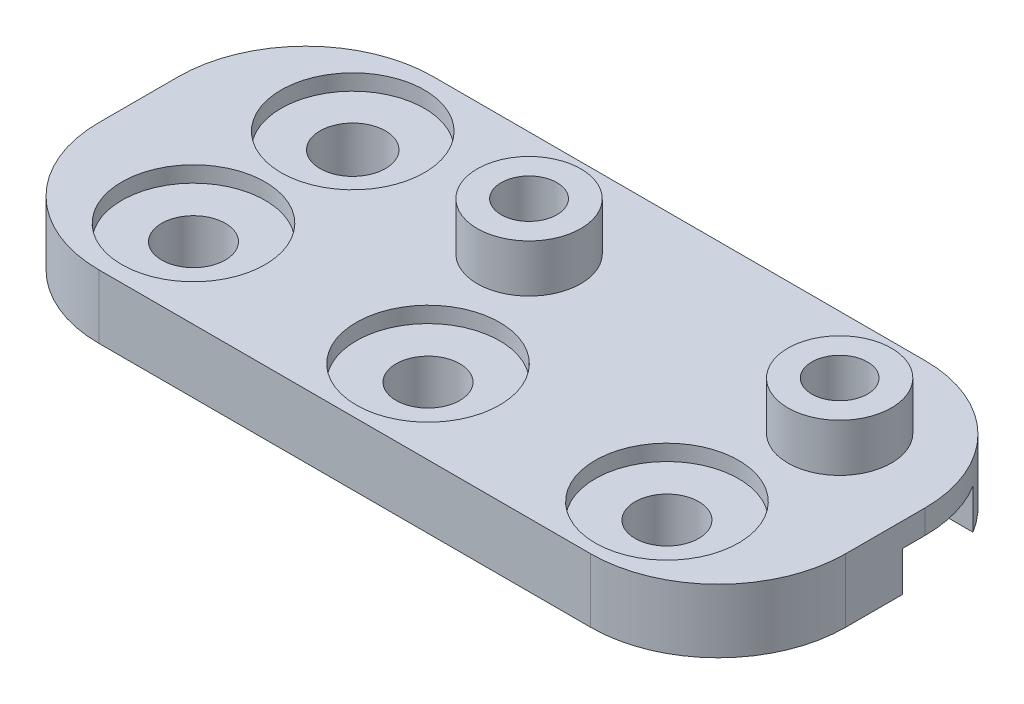
ISO-10303-21;
HEADER;
FILE_DESCRIPTION(('STEP AP214'),'2;1');
FILE_NAME('part.step','',(''),(''),'','','');
FILE_SCHEMA(('AUTOMOTIVE_DESIGN { 1 0 10303 214 1 1 1 1 }'));
ENDSEC;
DATA;
#1=APPLICATION_CONTEXT('core data for automotive mechanical design processes');
#2=APPLICATION_PROTOCOL_DEFINITION('international standard','automotive_design',2000,#1);
#3=PRODUCT_CONTEXT('',#1,'mechanical');
#4=PRODUCT('Part','Part','',(#3));
#5=PRODUCT_RELATED_PRODUCT_CATEGORY('part','',(#4));
#6=PRODUCT_DEFINITION_FORMATION('','',#4);
#7=PRODUCT_DEFINITION_CONTEXT('part definition',#1,'design');
#8=PRODUCT_DEFINITION('design','',#6,#7);
#9=PRODUCT_DEFINITION_SHAPE('','',#8);
#10=(LENGTH_UNIT() NAMED_UNIT(*) SI_UNIT(.MILLI.,.METRE.));
#11=(NAMED_UNIT(*) PLANE_ANGLE_UNIT() SI_UNIT($,.RADIAN.));
#12=(NAMED_UNIT(*) SI_UNIT($,.STERADIAN.) SOLID_ANGLE_UNIT());
#13=UNCERTAINTY_MEASURE_WITH_UNIT(LENGTH_MEASURE(1.E-05),#10,'distance_accuracy_value','');
#14=(GEOMETRIC_REPRESENTATION_CONTEXT(3) GLOBAL_UNCERTAINTY_ASSIGNED_CONTEXT((#13)) GLOBAL_UNIT_ASSIGNED_CONTEXT((#10,
#11,#12)) REPRESENTATION_CONTEXT('',''));
#15=CARTESIAN_POINT('',(0.,0.,0.));
#16=DIRECTION('',(0.,0.,1.));
#17=DIRECTION('',(1.,0.,0.));
#18=AXIS2_PLACEMENT_3D('',#15,#16,#17);
#19=CARTESIAN_POINT('',(23.4419140413245,4.,0.));
#20=DIRECTION('',(1.,0.,0.));
#21=DIRECTION('',(0.,0.,-1.));
#22=AXIS2_PLACEMENT_3D('',#19,#20,#21);
#23=PLANE('',#22);
#24=DIRECTION('',(0.,0.,1.));
#25=VECTOR('',#24,1.);
#26=CARTESIAN_POINT('',(23.4419140413245,0.,0.));
#27=LINE('',#26,#25);
#28=CARTESIAN_POINT('',(23.4419140413245,0.,-2.4));
#29=VERTEX_POINT('',#28);
#30=CARTESIAN_POINT('',(23.4419140413245,0.,1.17052230901994));
#31=VERTEX_POINT('',#30);
#32=EDGE_CURVE('E249',#29,#31,#27,.T.);
#33=ORIENTED_EDGE('',*,*,#32,.F.);
#34=DIRECTION('',(0.,-1.,0.));
#35=VECTOR('',#34,1.);
#36=CARTESIAN_POINT('',(23.4419140413245,2.5,-2.4));
#37=LINE('',#36,#35);
#38=CARTESIAN_POINT('',(23.4419140413245,2.5,-2.4));
#39=VERTEX_POINT('',#38);
#40=EDGE_CURVE('E164',#39,#29,#37,.T.);
#41=ORIENTED_EDGE('',*,*,#40,.F.);
#42=DIRECTION('',(0.,0.,1.));
#43=VECTOR('',#42,1.);
#44=CARTESIAN_POINT('',(23.4419140413245,2.5,0.));
#45=LINE('',#44,#43);
#46=CARTESIAN_POINT('',(23.4419140413245,2.5,-3.82947769098007));
#47=VERTEX_POINT('',#46);
#48=EDGE_CURVE('E145',#47,#39,#45,.T.);
#49=ORIENTED_EDGE('',*,*,#48,.F.);
#50=DIRECTION('',(0.,-1.,0.));
#51=VECTOR('',#50,1.);
#52=CARTESIAN_POINT('',(23.4419140413245,4.,-3.82947769098007));
#53=LINE('',#52,#51);
#54=CARTESIAN_POINT('',(23.4419140413245,4.,-3.82947769098007));
#55=VERTEX_POINT('',#54);
#56=EDGE_CURVE('E283',#47,#55,#53,.F.);
#57=ORIENTED_EDGE('',*,*,#56,.T.);
#58=DIRECTION('',(0.,0.,1.));
#59=VECTOR('',#58,1.);
#60=CARTESIAN_POINT('',(23.4419140413245,4.,0.));
#61=LINE('',#60,#59);
#62=CARTESIAN_POINT('',(23.4419140413245,4.,1.17052230901994));
#63=VERTEX_POINT('',#62);
#64=EDGE_CURVE('E235',#55,#63,#61,.T.);
#65=ORIENTED_EDGE('',*,*,#64,.T.);
#66=DIRECTION('',(0.,-1.,0.));
#67=VECTOR('',#66,1.);
#68=CARTESIAN_POINT('',(23.4419140413245,0.,1.17052230901994));
#69=LINE('',#68,#67);
#70=EDGE_CURVE('E285',#63,#31,#69,.T.);
#71=ORIENTED_EDGE('',*,*,#70,.T.);
#72=EDGE_LOOP('',(#33,#41,#49,#57,#65,#71));
#73=FACE_BOUND('',#72,.T.);
#74=ADVANCED_FACE('F35',(#73),#23,.T.);
#75=CARTESIAN_POINT('',(0.,0.,0.));
#76=DIRECTION('',(0.,1.,0.));
#77=DIRECTION('',(0.,0.,1.));
#78=AXIS2_PLACEMENT_3D('',#75,#76,#77);
#79=PLANE('',#78);
#80=CARTESIAN_POINT('',(-14.9975098421736,0.,3.67052230901994));
#81=DIRECTION('',(0.,1.,0.));
#82=DIRECTION('',(0.,0.,1.));
#83=AXIS2_PLACEMENT_3D('',#80,#81,#82);
#84=CIRCLE('',#83,2.);
#85=CARTESIAN_POINT('',(-14.9975098421736,0.,5.67052230901994));
#86=VERTEX_POINT('',#85);
#87=EDGE_CURVE('E224',#86,#86,#84,.T.);
#88=ORIENTED_EDGE('',*,*,#87,.T.);
#89=EDGE_LOOP('',(#88));
#90=FACE_BOUND('',#89,.T.);
#91=CARTESIAN_POINT('',(-14.9975098421736,0.,-6.32947769098006));
#92=DIRECTION('',(0.,1.,0.));
#93=DIRECTION('',(0.,0.,1.));
#94=AXIS2_PLACEMENT_3D('',#91,#92,#93);
#95=CIRCLE('',#94,2.05405042790199);
#96=CARTESIAN_POINT('',(-14.9975098421736,0.,-4.27542726307808));
#97=VERTEX_POINT('',#96);
#98=EDGE_CURVE('E251',#97,#97,#95,.T.);
#99=ORIENTED_EDGE('',*,*,#98,.T.);
#100=EDGE_LOOP('',(#99));
#101=FACE_BOUND('',#100,.T.);
#102=CARTESIAN_POINT('',(0.,0.,3.94383263430374));
#103=DIRECTION('',(0.,1.,0.));
#104=DIRECTION('',(0.,0.,1.));
#105=AXIS2_PLACEMENT_3D('',#102,#103,#104);
#106=CIRCLE('',#105,2.);
#107=CARTESIAN_POINT('',(0.,0.,5.94383263430374));
#108=VERTEX_POINT('',#107);
#109=EDGE_CURVE('E219',#108,#108,#106,.T.);
#110=ORIENTED_EDGE('',*,*,#109,.T.);
#111=EDGE_LOOP('',(#110));
#112=FACE_BOUND('',#111,.T.);
#113=CARTESIAN_POINT('',(15.,0.,3.94383263430374));
#114=DIRECTION('',(0.,1.,0.));
#115=DIRECTION('',(0.,0.,1.));
#116=AXIS2_PLACEMENT_3D('',#113,#114,#115);
#117=CIRCLE('',#116,2.00000000000001);
#118=CARTESIAN_POINT('',(15.,0.,5.94383263430375));
#119=VERTEX_POINT('',#118);
#120=EDGE_CURVE('E188',#119,#119,#117,.T.);
#121=ORIENTED_EDGE('',*,*,#120,.T.);
#122=EDGE_LOOP('',(#121));
#123=FACE_BOUND('',#122,.T.);
#124=DIRECTION('',(1.,0.,0.));
#125=VECTOR('',#124,1.);
#126=CARTESIAN_POINT('',(0.,0.,-2.40000000000001));
#127=LINE('',#126,#125);
#128=CARTESIAN_POINT('',(-6.0331615074619,0.,-2.40000000000001));
#129=VERTEX_POINT('',#128);
#130=EDGE_CURVE('E138',#129,#29,#127,.T.);
#131=ORIENTED_EDGE('',*,*,#130,.T.);
#132=ORIENTED_EDGE('',*,*,#32,.T.);
#133=CARTESIAN_POINT('',(15.4419140413245,0.,1.17052230901993));
#134=DIRECTION('',(0.,1.,0.));
#135=DIRECTION('',(0.,0.,1.));
#136=AXIS2_PLACEMENT_3D('',#133,#134,#135);
#137=CIRCLE('',#136,8.);
#138=CARTESIAN_POINT('',(15.4419140413245,0.,9.17052230901994));
#139=VERTEX_POINT('',#138);
#140=EDGE_CURVE('E267',#31,#139,#137,.F.);
#141=ORIENTED_EDGE('',*,*,#140,.T.);
#142=DIRECTION('',(1.,0.,0.));
#143=VECTOR('',#142,1.);
#144=CARTESIAN_POINT('',(0.,0.,9.17052230901994));
#145=LINE('',#144,#143);
#146=CARTESIAN_POINT('',(-15.4419140413245,0.,9.17052230901994));
#147=VERTEX_POINT('',#146);
#148=EDGE_CURVE('E246',#147,#139,#145,.T.);
#149=ORIENTED_EDGE('',*,*,#148,.F.);
#150=CARTESIAN_POINT('',(-15.4419140413245,0.,1.17052230901993));
#151=DIRECTION('',(0.,1.,0.));
#152=DIRECTION('',(0.,0.,1.));
#153=AXIS2_PLACEMENT_3D('',#150,#151,#152);
#154=CIRCLE('',#153,8.);
#155=CARTESIAN_POINT('',(-23.4419140413245,0.,1.17052230901994));
#156=VERTEX_POINT('',#155);
#157=EDGE_CURVE('E269',#147,#156,#154,.F.);
#158=ORIENTED_EDGE('',*,*,#157,.T.);
#159=DIRECTION('',(0.,0.,1.));
#160=VECTOR('',#159,1.);
#161=CARTESIAN_POINT('',(-23.4419140413245,0.,0.));
#162=LINE('',#161,#160);
#163=CARTESIAN_POINT('',(-23.4419140413245,0.,-3.82947769098006));
#164=VERTEX_POINT('',#163);
#165=EDGE_CURVE('E243',#164,#156,#162,.T.);
#166=ORIENTED_EDGE('',*,*,#165,.F.);
#167=CARTESIAN_POINT('',(-15.4419140413245,0.,-3.82947769098006));
#168=DIRECTION('',(0.,1.,0.));
#169=DIRECTION('',(0.,0.,1.));
#170=AXIS2_PLACEMENT_3D('',#167,#168,#169);
#171=CIRCLE('',#170,8.);
#172=CARTESIAN_POINT('',(-15.4419140413245,0.,-11.8294776909801));
#173=VERTEX_POINT('',#172);
#174=EDGE_CURVE('E265',#164,#173,#171,.F.);
#175=ORIENTED_EDGE('',*,*,#174,.T.);
#176=DIRECTION('',(1.,0.,0.));
#177=VECTOR('',#176,1.);
#178=CARTESIAN_POINT('',(0.,0.,-11.8294776909801));
#179=LINE('',#178,#177);
#180=CARTESIAN_POINT('',(15.4419140413245,0.,-11.8294776909801));
#181=VERTEX_POINT('',#180);
#182=EDGE_CURVE('E240',#173,#181,#179,.T.);
#183=ORIENTED_EDGE('',*,*,#182,.T.);
#184=CARTESIAN_POINT('',(15.4419140413245,0.,-3.82947769098007));
#185=DIRECTION('',(0.,1.,0.));
#186=DIRECTION('',(0.,0.,1.));
#187=AXIS2_PLACEMENT_3D('',#184,#185,#186);
#188=CIRCLE('',#187,8.);
#189=CARTESIAN_POINT('',(22.2688272288469,0.,-8.00000000000001));
#190=VERTEX_POINT('',#189);
#191=EDGE_CURVE('E262',#181,#190,#188,.F.);
#192=ORIENTED_EDGE('',*,*,#191,.T.);
#193=DIRECTION('',(-1.,0.,0.));
#194=VECTOR('',#193,1.);
#195=CARTESIAN_POINT('',(0.,0.,-8.));
#196=LINE('',#195,#194);
#197=CARTESIAN_POINT('',(-6.0331615074619,0.,-8.));
#198=VERTEX_POINT('',#197);
#199=EDGE_CURVE('E147',#190,#198,#196,.T.);
#200=ORIENTED_EDGE('',*,*,#199,.T.);
#201=DIRECTION('',(0.,0.,1.));
#202=VECTOR('',#201,1.);
#203=CARTESIAN_POINT('',(-6.0331615074619,0.,0.));
#204=LINE('',#203,#202);
#205=EDGE_CURVE('E150',#198,#129,#204,.T.);
#206=ORIENTED_EDGE('',*,*,#205,.T.);
#207=EDGE_LOOP('',(#131,#132,#141,#149,#158,#166,#175,#183,#192,#200,#206));
#208=FACE_BOUND('',#207,.T.);
#209=ADVANCED_FACE('F297',(#90,#101,#112,#123,#208),#79,.F.);
#210=CARTESIAN_POINT('',(-2.8,7.001,-5.2));
#211=DIRECTION('',(0.,-1.,0.));
#212=DIRECTION('',(0.,0.,-1.));
#213=AXIS2_PLACEMENT_3D('',#210,#211,#212);
#214=CYLINDRICAL_SURFACE('',#213,1.75);
#215=CARTESIAN_POINT('',(-2.8,7.,-5.2));
#216=DIRECTION('',(0.,1.,0.));
#217=DIRECTION('',(0.,0.,1.));
#218=AXIS2_PLACEMENT_3D('',#215,#216,#217);
#219=CIRCLE('',#218,1.75);
#220=CARTESIAN_POINT('',(-2.8,7.,-3.45));
#221=VERTEX_POINT('',#220);
#222=EDGE_CURVE('E207',#221,#221,#219,.T.);
#223=ORIENTED_EDGE('',*,*,#222,.T.);
#224=EDGE_LOOP('',(#223));
#225=FACE_BOUND('',#224,.T.);
#226=CARTESIAN_POINT('',(-2.8,2.5,-5.2));
#227=DIRECTION('',(0.,-1.,0.));
#228=DIRECTION('',(0.,0.,-1.));
#229=AXIS2_PLACEMENT_3D('',#226,#227,#228);
#230=CIRCLE('',#229,1.75);
#231=CARTESIAN_POINT('',(-2.8,2.5,-6.95));
#232=VERTEX_POINT('',#231);
#233=EDGE_CURVE('E140',#232,#232,#230,.F.);
#234=ORIENTED_EDGE('',*,*,#233,.F.);
#235=EDGE_LOOP('',(#234));
#236=FACE_BOUND('',#235,.T.);
#237=ADVANCED_FACE('F341',(#225,#236),#214,.F.);
#238=CARTESIAN_POINT('',(16.7,7.001,-5.2));
#239=DIRECTION('',(0.,-1.,0.));
#240=DIRECTION('',(0.,0.,-1.));
#241=AXIS2_PLACEMENT_3D('',#238,#239,#240);
#242=CYLINDRICAL_SURFACE('',#241,1.75);
#243=CARTESIAN_POINT('',(16.7,7.,-5.2));
#244=DIRECTION('',(0.,1.,0.));
#245=DIRECTION('',(0.,0.,1.));
#246=AXIS2_PLACEMENT_3D('',#243,#244,#245);
#247=CIRCLE('',#246,1.75);
#248=CARTESIAN_POINT('',(16.7,7.,-3.45));
#249=VERTEX_POINT('',#248);
#250=EDGE_CURVE('E211',#249,#249,#247,.T.);
#251=ORIENTED_EDGE('',*,*,#250,.T.);
#252=EDGE_LOOP('',(#251));
#253=FACE_BOUND('',#252,.T.);
#254=CARTESIAN_POINT('',(16.7,2.5,-5.2));
#255=DIRECTION('',(0.,-1.,0.));
#256=DIRECTION('',(0.,0.,-1.));
#257=AXIS2_PLACEMENT_3D('',#254,#255,#256);
#258=CIRCLE('',#257,1.75);
#259=CARTESIAN_POINT('',(16.7,2.5,-6.95));
#260=VERTEX_POINT('',#259);
#261=EDGE_CURVE('E157',#260,#260,#258,.F.);
#262=ORIENTED_EDGE('',*,*,#261,.F.);
#263=EDGE_LOOP('',(#262));
#264=FACE_BOUND('',#263,.T.);
#265=ADVANCED_FACE('F420',(#253,#264),#242,.F.);
#266=CARTESIAN_POINT('',(15.4419140413245,4.,-3.82947769098007));
#267=DIRECTION('',(0.,-1.,0.));
#268=DIRECTION('',(0.,0.,-1.));
#269=AXIS2_PLACEMENT_3D('',#266,#267,#268);
#270=CYLINDRICAL_SURFACE('',#269,8.);
#271=CARTESIAN_POINT('',(15.4419140413245,2.5,-3.82947769098007));
#272=DIRECTION('',(0.,-1.,0.));
#273=DIRECTION('',(0.,0.,-1.));
#274=AXIS2_PLACEMENT_3D('',#271,#272,#273);
#275=CIRCLE('',#274,8.);
#276=CARTESIAN_POINT('',(22.2688272288469,2.5,-8.));
#277=VERTEX_POINT('',#276);
#278=EDGE_CURVE('E154',#277,#47,#275,.T.);
#279=ORIENTED_EDGE('',*,*,#278,.F.);
#280=DIRECTION('',(0.,-1.,0.));
#281=VECTOR('',#280,1.);
#282=CARTESIAN_POINT('',(22.2688272288469,2.5,-8.00000000000001));
#283=LINE('',#282,#281);
#284=EDGE_CURVE('E167',#277,#190,#283,.T.);
#285=ORIENTED_EDGE('',*,*,#284,.T.);
#286=ORIENTED_EDGE('',*,*,#191,.F.);
#287=DIRECTION('',(0.,-1.,0.));
#288=VECTOR('',#287,1.);
#289=CARTESIAN_POINT('',(15.4419140413245,4.,-11.8294776909801));
#290=LINE('',#289,#288);
#291=CARTESIAN_POINT('',(15.4419140413245,4.,-11.8294776909801));
#292=VERTEX_POINT('',#291);
#293=EDGE_CURVE('E43',#292,#181,#290,.T.);
#294=ORIENTED_EDGE('',*,*,#293,.F.);
#295=CARTESIAN_POINT('',(15.4419140413245,4.,-3.82947769098007));
#296=DIRECTION('',(0.,1.,0.));
#297=DIRECTION('',(0.,0.,1.));
#298=AXIS2_PLACEMENT_3D('',#295,#296,#297);
#299=CIRCLE('',#298,8.);
#300=EDGE_CURVE('E276',#55,#292,#299,.T.);
#301=ORIENTED_EDGE('',*,*,#300,.F.);
#302=ORIENTED_EDGE('',*,*,#56,.F.);
#303=EDGE_LOOP('',(#279,#285,#286,#294,#301,#302));
#304=FACE_BOUND('',#303,.T.);
#305=ADVANCED_FACE('F37',(#304),#270,.T.);
#306=CARTESIAN_POINT('',(0.,4.,3.94383263430374));
#307=DIRECTION('',(0.,-1.,0.));
#308=DIRECTION('',(0.,0.,-1.));
#309=AXIS2_PLACEMENT_3D('',#306,#307,#308);
#310=CYLINDRICAL_SURFACE('',#309,2.);
#311=ORIENTED_EDGE('',*,*,#109,.F.);
#312=EDGE_LOOP('',(#311));
#313=FACE_BOUND('',#312,.T.);
#314=CARTESIAN_POINT('',(0.,3.,3.94383263430374));
#315=DIRECTION('',(0.,1.,0.));
#316=DIRECTION('',(0.,0.,1.));
#317=AXIS2_PLACEMENT_3D('',#314,#315,#316);
#318=CIRCLE('',#317,2.00000000000001);
#319=CARTESIAN_POINT('',(0.,3.,5.94383263430376));
#320=VERTEX_POINT('',#319);
#321=EDGE_CURVE('E176',#320,#320,#318,.T.);
#322=ORIENTED_EDGE('',*,*,#321,.T.);
#323=EDGE_LOOP('',(#322));
#324=FACE_BOUND('',#323,.T.);
#325=ADVANCED_FACE('F355',(#313,#324),#310,.F.);
#326=CARTESIAN_POINT('',(-14.9975098421736,4.,3.67052230901994));
#327=DIRECTION('',(0.,-1.,0.));
#328=DIRECTION('',(0.,0.,-1.));
#329=AXIS2_PLACEMENT_3D('',#326,#327,#328);
#330=CYLINDRICAL_SURFACE('',#329,2.);
#331=ORIENTED_EDGE('',*,*,#87,.F.);
#332=EDGE_LOOP('',(#331));
#333=FACE_BOUND('',#332,.T.);
#334=CARTESIAN_POINT('',(-14.9975098421736,3.,3.67052230901994));
#335=DIRECTION('',(0.,1.,0.));
#336=DIRECTION('',(0.,0.,1.));
#337=AXIS2_PLACEMENT_3D('',#334,#335,#336);
#338=CIRCLE('',#337,2.00000000000001);
#339=CARTESIAN_POINT('',(-14.9975098421736,3.,5.67052230901995));
#340=VERTEX_POINT('',#339);
#341=EDGE_CURVE('E197',#340,#340,#338,.T.);
#342=ORIENTED_EDGE('',*,*,#341,.T.);
#343=EDGE_LOOP('',(#342));
#344=FACE_BOUND('',#343,.T.);
#345=ADVANCED_FACE('F354',(#333,#344),#330,.F.);
#346=CARTESIAN_POINT('',(0.,4.,-11.8294776909801));
#347=DIRECTION('',(0.,0.,-1.));
#348=DIRECTION('',(-1.,0.,0.));
#349=AXIS2_PLACEMENT_3D('',#346,#347,#348);
#350=PLANE('',#349);
#351=ORIENTED_EDGE('',*,*,#182,.F.);
#352=DIRECTION('',(0.,-1.,0.));
#353=VECTOR('',#352,1.);
#354=CARTESIAN_POINT('',(-15.4419140413245,4.,-11.8294776909801));
#355=LINE('',#354,#353);
#356=CARTESIAN_POINT('',(-15.4419140413245,4.,-11.8294776909801));
#357=VERTEX_POINT('',#356);
#358=EDGE_CURVE('E11',#173,#357,#355,.F.);
#359=ORIENTED_EDGE('',*,*,#358,.T.);
#360=DIRECTION('',(1.,0.,0.));
#361=VECTOR('',#360,1.);
#362=CARTESIAN_POINT('',(0.,4.,-11.8294776909801));
#363=LINE('',#362,#361);
#364=EDGE_CURVE('E227',#357,#292,#363,.T.);
#365=ORIENTED_EDGE('',*,*,#364,.T.);
#366=ORIENTED_EDGE('',*,*,#293,.T.);
#367=EDGE_LOOP('',(#351,#359,#365,#366));
#368=FACE_BOUND('',#367,.T.);
#369=ADVANCED_FACE('F291',(#368),#350,.T.);
#370=CARTESIAN_POINT('',(-23.4419140413245,4.,0.));
#371=DIRECTION('',(1.,0.,0.));
#372=DIRECTION('',(0.,0.,-1.));
#373=AXIS2_PLACEMENT_3D('',#370,#371,#372);
#374=PLANE('',#373);
#375=ORIENTED_EDGE('',*,*,#165,.T.);
#376=DIRECTION('',(0.,-1.,0.));
#377=VECTOR('',#376,1.);
#378=CARTESIAN_POINT('',(-23.4419140413245,4.,1.17052230901994));
#379=LINE('',#378,#377);
#380=CARTESIAN_POINT('',(-23.4419140413245,4.,1.17052230901994));
#381=VERTEX_POINT('',#380);
#382=EDGE_CURVE('E274',#156,#381,#379,.F.);
#383=ORIENTED_EDGE('',*,*,#382,.T.);
#384=DIRECTION('',(0.,0.,1.));
#385=VECTOR('',#384,1.);
#386=CARTESIAN_POINT('',(-23.4419140413245,4.,0.));
#387=LINE('',#386,#385);
#388=CARTESIAN_POINT('',(-23.4419140413245,4.,-3.82947769098006));
#389=VERTEX_POINT('',#388);
#390=EDGE_CURVE('E230',#389,#381,#387,.T.);
#391=ORIENTED_EDGE('',*,*,#390,.F.);
#392=DIRECTION('',(0.,-1.,0.));
#393=VECTOR('',#392,1.);
#394=CARTESIAN_POINT('',(-23.4419140413245,0.,-3.82947769098006));
#395=LINE('',#394,#393);
#396=EDGE_CURVE('E271',#389,#164,#395,.T.);
#397=ORIENTED_EDGE('',*,*,#396,.T.);
#398=EDGE_LOOP('',(#375,#383,#391,#397));
#399=FACE_BOUND('',#398,.T.);
#400=ADVANCED_FACE('F305',(#399),#374,.F.);
#401=CARTESIAN_POINT('',(0.,4.,9.17052230901994));
#402=DIRECTION('',(0.,0.,-1.));
#403=DIRECTION('',(-1.,0.,0.));
#404=AXIS2_PLACEMENT_3D('',#401,#402,#403);
#405=PLANE('',#404);
#406=DIRECTION('',(1.,0.,0.));
#407=VECTOR('',#406,1.);
#408=CARTESIAN_POINT('',(0.,4.,9.17052230901994));
#409=LINE('',#408,#407);
#410=CARTESIAN_POINT('',(-15.4419140413245,4.,9.17052230901994));
#411=VERTEX_POINT('',#410);
#412=CARTESIAN_POINT('',(15.4419140413245,4.,9.17052230901994));
#413=VERTEX_POINT('',#412);
#414=EDGE_CURVE('E233',#411,#413,#409,.T.);
#415=ORIENTED_EDGE('',*,*,#414,.F.);
#416=DIRECTION('',(0.,-1.,0.));
#417=VECTOR('',#416,1.);
#418=CARTESIAN_POINT('',(-15.4419140413245,4.,9.17052230901994));
#419=LINE('',#418,#417);
#420=EDGE_CURVE('E259',#411,#147,#419,.T.);
#421=ORIENTED_EDGE('',*,*,#420,.T.);
#422=ORIENTED_EDGE('',*,*,#148,.T.);
#423=DIRECTION('',(0.,-1.,0.));
#424=VECTOR('',#423,1.);
#425=CARTESIAN_POINT('',(15.4419140413245,4.,9.17052230901994));
#426=LINE('',#425,#424);
#427=EDGE_CURVE('E237',#139,#413,#426,.F.);
#428=ORIENTED_EDGE('',*,*,#427,.T.);
#429=EDGE_LOOP('',(#415,#421,#422,#428));
#430=FACE_BOUND('',#429,.T.);
#431=ADVANCED_FACE('F315',(#430),#405,.F.);
#432=CARTESIAN_POINT('',(-14.9975098421736,4.,-6.32947769098006));
#433=DIRECTION('',(0.,-1.,0.));
#434=DIRECTION('',(0.,0.,-1.));
#435=AXIS2_PLACEMENT_3D('',#432,#433,#434);
#436=CYLINDRICAL_SURFACE('',#435,2.05405042790199);
#437=CARTESIAN_POINT('',(-14.9975098421736,3.,-6.32947769098006));
#438=DIRECTION('',(0.,-1.,0.));
#439=DIRECTION('',(0.,0.,-1.));
#440=AXIS2_PLACEMENT_3D('',#437,#438,#439);
#441=CIRCLE('',#440,2.05405042790199);
#442=CARTESIAN_POINT('',(-14.9975098421736,3.,-8.38352811888205));
#443=VERTEX_POINT('',#442);
#444=EDGE_CURVE('E206',#443,#443,#441,.T.);
#445=ORIENTED_EDGE('',*,*,#444,.F.);
#446=EDGE_LOOP('',(#445));
#447=FACE_BOUND('',#446,.T.);
#448=ORIENTED_EDGE('',*,*,#98,.F.);
#449=EDGE_LOOP('',(#448));
#450=FACE_BOUND('',#449,.T.);
#451=ADVANCED_FACE('F346',(#447,#450),#436,.F.);
#452=CARTESIAN_POINT('',(0.,4.,0.));
#453=DIRECTION('',(0.,1.,0.));
#454=DIRECTION('',(0.,0.,1.));
#455=AXIS2_PLACEMENT_3D('',#452,#453,#454);
#456=PLANE('',#455);
#457=CARTESIAN_POINT('',(0.,4.,3.94383263430374));
#458=DIRECTION('',(0.,1.,0.));
#459=DIRECTION('',(0.,0.,1.));
#460=AXIS2_PLACEMENT_3D('',#457,#458,#459);
#461=CIRCLE('',#460,4.50000000000001);
#462=CARTESIAN_POINT('',(0.,4.,8.44383263430375));
#463=VERTEX_POINT('',#462);
#464=EDGE_CURVE('E166',#463,#463,#461,.T.);
#465=ORIENTED_EDGE('',*,*,#464,.F.);
#466=EDGE_LOOP('',(#465));
#467=FACE_BOUND('',#466,.T.);
#468=CARTESIAN_POINT('',(15.,4.,3.94383263430374));
#469=DIRECTION('',(0.,1.,0.));
#470=DIRECTION('',(0.,0.,1.));
#471=AXIS2_PLACEMENT_3D('',#468,#469,#470);
#472=CIRCLE('',#471,4.50000000000001);
#473=CARTESIAN_POINT('',(15.,4.,8.44383263430375));
#474=VERTEX_POINT('',#473);
#475=EDGE_CURVE('E179',#474,#474,#472,.T.);
#476=ORIENTED_EDGE('',*,*,#475,.F.);
#477=EDGE_LOOP('',(#476));
#478=FACE_BOUND('',#477,.T.);
#479=CARTESIAN_POINT('',(-14.9975098421736,4.,3.67052230901994));
#480=DIRECTION('',(0.,1.,0.));
#481=DIRECTION('',(0.,0.,1.));
#482=AXIS2_PLACEMENT_3D('',#479,#480,#481);
#483=CIRCLE('',#482,4.50000000000001);
#484=CARTESIAN_POINT('',(-14.9975098421736,4.,8.17052230901995));
#485=VERTEX_POINT('',#484);
#486=EDGE_CURVE('E191',#485,#485,#483,.T.);
#487=ORIENTED_EDGE('',*,*,#486,.F.);
#488=EDGE_LOOP('',(#487));
#489=FACE_BOUND('',#488,.T.);
#490=CARTESIAN_POINT('',(-14.9975098421736,4.,-6.32947769098006));
#491=DIRECTION('',(0.,1.,0.));
#492=DIRECTION('',(0.,0.,1.));
#493=AXIS2_PLACEMENT_3D('',#490,#491,#492);
#494=CIRCLE('',#493,4.50000000000001);
#495=CARTESIAN_POINT('',(-14.9975098421736,4.,-1.82947769098005));
#496=VERTEX_POINT('',#495);
#497=EDGE_CURVE('E200',#496,#496,#494,.T.);
#498=ORIENTED_EDGE('',*,*,#497,.F.);
#499=EDGE_LOOP('',(#498));
#500=FACE_BOUND('',#499,.T.);
#501=CARTESIAN_POINT('',(-2.8,4.,-5.2));
#502=DIRECTION('',(0.,1.,0.));
#503=DIRECTION('',(0.,0.,1.));
#504=AXIS2_PLACEMENT_3D('',#501,#502,#503);
#505=CIRCLE('',#504,3.25);
#506=CARTESIAN_POINT('',(-2.8,4.,-1.95));
#507=VERTEX_POINT('',#506);
#508=EDGE_CURVE('E220',#507,#507,#505,.T.);
#509=ORIENTED_EDGE('',*,*,#508,.F.);
#510=EDGE_LOOP('',(#509));
#511=FACE_BOUND('',#510,.T.);
#512=CARTESIAN_POINT('',(16.7,4.,-5.2));
#513=DIRECTION('',(0.,1.,0.));
#514=DIRECTION('',(0.,0.,1.));
#515=AXIS2_PLACEMENT_3D('',#512,#513,#514);
#516=CIRCLE('',#515,3.25);
#517=CARTESIAN_POINT('',(16.7,4.,-1.95));
#518=VERTEX_POINT('',#517);
#519=EDGE_CURVE('E223',#518,#518,#516,.T.);
#520=ORIENTED_EDGE('',*,*,#519,.F.);
#521=EDGE_LOOP('',(#520));
#522=FACE_BOUND('',#521,.T.);
#523=ORIENTED_EDGE('',*,*,#390,.T.);
#524=CARTESIAN_POINT('',(-15.4419140413245,4.,1.17052230901993));
#525=DIRECTION('',(0.,1.,0.));
#526=DIRECTION('',(0.,0.,1.));
#527=AXIS2_PLACEMENT_3D('',#524,#525,#526);
#528=CIRCLE('',#527,8.);
#529=EDGE_CURVE('E281',#381,#411,#528,.T.);
#530=ORIENTED_EDGE('',*,*,#529,.T.);
#531=ORIENTED_EDGE('',*,*,#414,.T.);
#532=CARTESIAN_POINT('',(15.4419140413245,4.,1.17052230901993));
#533=DIRECTION('',(0.,1.,0.));
#534=DIRECTION('',(0.,0.,1.));
#535=AXIS2_PLACEMENT_3D('',#532,#533,#534);
#536=CIRCLE('',#535,8.);
#537=EDGE_CURVE('E58',#413,#63,#536,.T.);
#538=ORIENTED_EDGE('',*,*,#537,.T.);
#539=ORIENTED_EDGE('',*,*,#64,.F.);
#540=ORIENTED_EDGE('',*,*,#300,.T.);
#541=ORIENTED_EDGE('',*,*,#364,.F.);
#542=CARTESIAN_POINT('',(-15.4419140413245,4.,-3.82947769098006));
#543=DIRECTION('',(0.,1.,0.));
#544=DIRECTION('',(0.,0.,1.));
#545=AXIS2_PLACEMENT_3D('',#542,#543,#544);
#546=CIRCLE('',#545,8.);
#547=EDGE_CURVE('E278',#357,#389,#546,.T.);
#548=ORIENTED_EDGE('',*,*,#547,.T.);
#549=EDGE_LOOP('',(#523,#530,#531,#538,#539,#540,#541,#548));
#550=FACE_BOUND('',#549,.T.);
#551=ADVANCED_FACE('F308',(#467,#478,#489,#500,#511,#522,#550),#456,.T.);
#552=CARTESIAN_POINT('',(16.7,7.,-5.2));
#553=DIRECTION('',(0.,-1.,0.));
#554=DIRECTION('',(0.,0.,-1.));
#555=AXIS2_PLACEMENT_3D('',#552,#553,#554);
#556=CYLINDRICAL_SURFACE('',#555,3.25);
#557=ORIENTED_EDGE('',*,*,#519,.T.);
#558=EDGE_LOOP('',(#557));
#559=FACE_BOUND('',#558,.T.);
#560=CARTESIAN_POINT('',(16.7,7.,-5.2));
#561=DIRECTION('',(0.,1.,0.));
#562=DIRECTION('',(0.,0.,1.));
#563=AXIS2_PLACEMENT_3D('',#560,#561,#562);
#564=CIRCLE('',#563,3.25);
#565=CARTESIAN_POINT('',(16.7,7.,-1.95));
#566=VERTEX_POINT('',#565);
#567=EDGE_CURVE('E216',#566,#566,#564,.T.);
#568=ORIENTED_EDGE('',*,*,#567,.F.);
#569=EDGE_LOOP('',(#568));
#570=FACE_BOUND('',#569,.T.);
#571=ADVANCED_FACE('F484',(#559,#570),#556,.T.);
#572=CARTESIAN_POINT('',(0.,7.,0.));
#573=DIRECTION('',(0.,1.,0.));
#574=DIRECTION('',(0.,0.,1.));
#575=AXIS2_PLACEMENT_3D('',#572,#573,#574);
#576=PLANE('',#575);
#577=ORIENTED_EDGE('',*,*,#250,.F.);
#578=EDGE_LOOP('',(#577));
#579=FACE_BOUND('',#578,.T.);
#580=ORIENTED_EDGE('',*,*,#567,.T.);
#581=EDGE_LOOP('',(#580));
#582=FACE_BOUND('',#581,.T.);
#583=ADVANCED_FACE('F480',(#579,#582),#576,.T.);
#584=CARTESIAN_POINT('',(-2.8,7.,-5.2));
#585=DIRECTION('',(0.,-1.,0.));
#586=DIRECTION('',(0.,0.,-1.));
#587=AXIS2_PLACEMENT_3D('',#584,#585,#586);
#588=CYLINDRICAL_SURFACE('',#587,3.25);
#589=ORIENTED_EDGE('',*,*,#508,.T.);
#590=EDGE_LOOP('',(#589));
#591=FACE_BOUND('',#590,.T.);
#592=CARTESIAN_POINT('',(-2.8,7.,-5.2));
#593=DIRECTION('',(0.,1.,0.));
#594=DIRECTION('',(0.,0.,1.));
#595=AXIS2_PLACEMENT_3D('',#592,#593,#594);
#596=CIRCLE('',#595,3.25);
#597=CARTESIAN_POINT('',(-2.8,7.,-1.95));
#598=VERTEX_POINT('',#597);
#599=EDGE_CURVE('E210',#598,#598,#596,.T.);
#600=ORIENTED_EDGE('',*,*,#599,.F.);
#601=EDGE_LOOP('',(#600));
#602=FACE_BOUND('',#601,.T.);
#603=ADVANCED_FACE('F476',(#591,#602),#588,.T.);
#604=CARTESIAN_POINT('',(0.,7.,0.));
#605=DIRECTION('',(0.,1.,0.));
#606=DIRECTION('',(0.,0.,1.));
#607=AXIS2_PLACEMENT_3D('',#604,#605,#606);
#608=PLANE('',#607);
#609=ORIENTED_EDGE('',*,*,#222,.F.);
#610=EDGE_LOOP('',(#609));
#611=FACE_BOUND('',#610,.T.);
#612=ORIENTED_EDGE('',*,*,#599,.T.);
#613=EDGE_LOOP('',(#612));
#614=FACE_BOUND('',#613,.T.);
#615=ADVANCED_FACE('F473',(#611,#614),#608,.T.);
#616=CARTESIAN_POINT('',(-12.9975098421736,3.,-6.32947769098006));
#617=DIRECTION('',(0.,-1.,0.));
#618=DIRECTION('',(0.,0.,-1.));
#619=AXIS2_PLACEMENT_3D('',#616,#617,#618);
#620=PLANE('',#619);
#621=ORIENTED_EDGE('',*,*,#444,.T.);
#622=EDGE_LOOP('',(#621));
#623=FACE_BOUND('',#622,.T.);
#624=CARTESIAN_POINT('',(-14.9975098421736,3.,-6.32947769098006));
#625=DIRECTION('',(0.,1.,0.));
#626=DIRECTION('',(0.,0.,1.));
#627=AXIS2_PLACEMENT_3D('',#624,#625,#626);
#628=CIRCLE('',#627,4.50000000000001);
#629=CARTESIAN_POINT('',(-14.9975098421736,3.,-1.82947769098005));
#630=VERTEX_POINT('',#629);
#631=EDGE_CURVE('E203',#630,#630,#628,.T.);
#632=ORIENTED_EDGE('',*,*,#631,.T.);
#633=EDGE_LOOP('',(#632));
#634=FACE_BOUND('',#633,.T.);
#635=ADVANCED_FACE('F470',(#623,#634),#620,.F.);
#636=CARTESIAN_POINT('',(-14.9975098421736,4.,-6.32947769098006));
#637=DIRECTION('',(0.,1.,0.));
#638=DIRECTION('',(0.,0.,1.));
#639=AXIS2_PLACEMENT_3D('',#636,#637,#638);
#640=CYLINDRICAL_SURFACE('',#639,4.50000000000001);
#641=ORIENTED_EDGE('',*,*,#631,.F.);
#642=EDGE_LOOP('',(#641));
#643=FACE_BOUND('',#642,.T.);
#644=ORIENTED_EDGE('',*,*,#497,.T.);
#645=EDGE_LOOP('',(#644));
#646=FACE_BOUND('',#645,.T.);
#647=ADVANCED_FACE('F503',(#643,#646),#640,.F.);
#648=CARTESIAN_POINT('',(-12.9975098421736,3.,3.67052230901994));
#649=DIRECTION('',(0.,-1.,0.));
#650=DIRECTION('',(0.,0.,-1.));
#651=AXIS2_PLACEMENT_3D('',#648,#649,#650);
#652=PLANE('',#651);
#653=ORIENTED_EDGE('',*,*,#341,.F.);
#654=EDGE_LOOP('',(#653));
#655=FACE_BOUND('',#654,.T.);
#656=CARTESIAN_POINT('',(-14.9975098421736,3.,3.67052230901994));
#657=DIRECTION('',(0.,1.,0.));
#658=DIRECTION('',(0.,0.,1.));
#659=AXIS2_PLACEMENT_3D('',#656,#657,#658);
#660=CIRCLE('',#659,4.50000000000001);
#661=CARTESIAN_POINT('',(-14.9975098421736,3.,8.17052230901995));
#662=VERTEX_POINT('',#661);
#663=EDGE_CURVE('E194',#662,#662,#660,.T.);
#664=ORIENTED_EDGE('',*,*,#663,.T.);
#665=EDGE_LOOP('',(#664));
#666=FACE_BOUND('',#665,.T.);
#667=ADVANCED_FACE('F499',(#655,#666),#652,.F.);
#668=CARTESIAN_POINT('',(-14.9975098421736,4.,3.67052230901994));
#669=DIRECTION('',(0.,1.,0.));
#670=DIRECTION('',(0.,0.,1.));
#671=AXIS2_PLACEMENT_3D('',#668,#669,#670);
#672=CYLINDRICAL_SURFACE('',#671,4.50000000000001);
#673=ORIENTED_EDGE('',*,*,#663,.F.);
#674=EDGE_LOOP('',(#673));
#675=FACE_BOUND('',#674,.T.);
#676=ORIENTED_EDGE('',*,*,#486,.T.);
#677=EDGE_LOOP('',(#676));
#678=FACE_BOUND('',#677,.T.);
#679=ADVANCED_FACE('F502',(#675,#678),#672,.F.);
#680=CARTESIAN_POINT('',(15.,4.,3.94383263430374));
#681=DIRECTION('',(0.,1.,0.));
#682=DIRECTION('',(0.,0.,1.));
#683=AXIS2_PLACEMENT_3D('',#680,#681,#682);
#684=CYLINDRICAL_SURFACE('',#683,2.00000000000001);
#685=ORIENTED_EDGE('',*,*,#120,.F.);
#686=EDGE_LOOP('',(#685));
#687=FACE_BOUND('',#686,.T.);
#688=CARTESIAN_POINT('',(15.,3.,3.94383263430374));
#689=DIRECTION('',(0.,1.,0.));
#690=DIRECTION('',(0.,0.,1.));
#691=AXIS2_PLACEMENT_3D('',#688,#689,#690);
#692=CIRCLE('',#691,2.00000000000001);
#693=CARTESIAN_POINT('',(15.,3.,5.94383263430375));
#694=VERTEX_POINT('',#693);
#695=EDGE_CURVE('E185',#694,#694,#692,.T.);
#696=ORIENTED_EDGE('',*,*,#695,.T.);
#697=EDGE_LOOP('',(#696));
#698=FACE_BOUND('',#697,.T.);
#699=ADVANCED_FACE('F509',(#687,#698),#684,.F.);
#700=CARTESIAN_POINT('',(17.,3.,3.94383263430374));
#701=DIRECTION('',(0.,-1.,0.));
#702=DIRECTION('',(0.,0.,-1.));
#703=AXIS2_PLACEMENT_3D('',#700,#701,#702);
#704=PLANE('',#703);
#705=ORIENTED_EDGE('',*,*,#695,.F.);
#706=EDGE_LOOP('',(#705));
#707=FACE_BOUND('',#706,.T.);
#708=CARTESIAN_POINT('',(15.,3.,3.94383263430374));
#709=DIRECTION('',(0.,1.,0.));
#710=DIRECTION('',(0.,0.,1.));
#711=AXIS2_PLACEMENT_3D('',#708,#709,#710);
#712=CIRCLE('',#711,4.50000000000001);
#713=CARTESIAN_POINT('',(15.,3.,8.44383263430375));
#714=VERTEX_POINT('',#713);
#715=EDGE_CURVE('E182',#714,#714,#712,.T.);
#716=ORIENTED_EDGE('',*,*,#715,.T.);
#717=EDGE_LOOP('',(#716));
#718=FACE_BOUND('',#717,.T.);
#719=ADVANCED_FACE('F536',(#707,#718),#704,.F.);
#720=CARTESIAN_POINT('',(15.,4.,3.94383263430374));
#721=DIRECTION('',(0.,1.,0.));
#722=DIRECTION('',(0.,0.,1.));
#723=AXIS2_PLACEMENT_3D('',#720,#721,#722);
#724=CYLINDRICAL_SURFACE('',#723,4.50000000000001);
#725=ORIENTED_EDGE('',*,*,#715,.F.);
#726=EDGE_LOOP('',(#725));
#727=FACE_BOUND('',#726,.T.);
#728=ORIENTED_EDGE('',*,*,#475,.T.);
#729=EDGE_LOOP('',(#728));
#730=FACE_BOUND('',#729,.T.);
#731=ADVANCED_FACE('F540',(#727,#730),#724,.F.);
#732=CARTESIAN_POINT('',(2.00000000000002,3.,3.94383263430374));
#733=DIRECTION('',(0.,-1.,0.));
#734=DIRECTION('',(0.,0.,-1.));
#735=AXIS2_PLACEMENT_3D('',#732,#733,#734);
#736=PLANE('',#735);
#737=ORIENTED_EDGE('',*,*,#321,.F.);
#738=EDGE_LOOP('',(#737));
#739=FACE_BOUND('',#738,.T.);
#740=CARTESIAN_POINT('',(0.,3.,3.94383263430374));
#741=DIRECTION('',(0.,1.,0.));
#742=DIRECTION('',(0.,0.,1.));
#743=AXIS2_PLACEMENT_3D('',#740,#741,#742);
#744=CIRCLE('',#743,4.50000000000001);
#745=CARTESIAN_POINT('',(0.,3.,8.44383263430375));
#746=VERTEX_POINT('',#745);
#747=EDGE_CURVE('E173',#746,#746,#744,.T.);
#748=ORIENTED_EDGE('',*,*,#747,.T.);
#749=EDGE_LOOP('',(#748));
#750=FACE_BOUND('',#749,.T.);
#751=ADVANCED_FACE('F544',(#739,#750),#736,.F.);
#752=CARTESIAN_POINT('',(0.,4.,3.94383263430374));
#753=DIRECTION('',(0.,1.,0.));
#754=DIRECTION('',(0.,0.,1.));
#755=AXIS2_PLACEMENT_3D('',#752,#753,#754);
#756=CYLINDRICAL_SURFACE('',#755,4.50000000000001);
#757=ORIENTED_EDGE('',*,*,#747,.F.);
#758=EDGE_LOOP('',(#757));
#759=FACE_BOUND('',#758,.T.);
#760=ORIENTED_EDGE('',*,*,#464,.T.);
#761=EDGE_LOOP('',(#760));
#762=FACE_BOUND('',#761,.T.);
#763=ADVANCED_FACE('F361',(#759,#762),#756,.F.);
#764=CARTESIAN_POINT('',(-15.4419140413245,4.,1.17052230901993));
#765=DIRECTION('',(0.,-1.,0.));
#766=DIRECTION('',(0.,0.,-1.));
#767=AXIS2_PLACEMENT_3D('',#764,#765,#766);
#768=CYLINDRICAL_SURFACE('',#767,8.);
#769=ORIENTED_EDGE('',*,*,#529,.F.);
#770=ORIENTED_EDGE('',*,*,#382,.F.);
#771=ORIENTED_EDGE('',*,*,#157,.F.);
#772=ORIENTED_EDGE('',*,*,#420,.F.);
#773=EDGE_LOOP('',(#769,#770,#771,#772));
#774=FACE_BOUND('',#773,.T.);
#775=ADVANCED_FACE('F312',(#774),#768,.T.);
#776=CARTESIAN_POINT('',(15.4419140413245,4.,1.17052230901993));
#777=DIRECTION('',(0.,1.,0.));
#778=DIRECTION('',(0.,0.,1.));
#779=AXIS2_PLACEMENT_3D('',#776,#777,#778);
#780=CYLINDRICAL_SURFACE('',#779,8.);
#781=ORIENTED_EDGE('',*,*,#537,.F.);
#782=ORIENTED_EDGE('',*,*,#427,.F.);
#783=ORIENTED_EDGE('',*,*,#140,.F.);
#784=ORIENTED_EDGE('',*,*,#70,.F.);
#785=EDGE_LOOP('',(#781,#782,#783,#784));
#786=FACE_BOUND('',#785,.T.);
#787=ADVANCED_FACE('F321',(#786),#780,.T.);
#788=CARTESIAN_POINT('',(-15.4419140413245,4.,-3.82947769098006));
#789=DIRECTION('',(0.,1.,0.));
#790=DIRECTION('',(0.,0.,1.));
#791=AXIS2_PLACEMENT_3D('',#788,#789,#790);
#792=CYLINDRICAL_SURFACE('',#791,8.);
#793=ORIENTED_EDGE('',*,*,#547,.F.);
#794=ORIENTED_EDGE('',*,*,#358,.F.);
#795=ORIENTED_EDGE('',*,*,#174,.F.);
#796=ORIENTED_EDGE('',*,*,#396,.F.);
#797=EDGE_LOOP('',(#793,#794,#795,#796));
#798=FACE_BOUND('',#797,.T.);
#799=ADVANCED_FACE('F302',(#798),#792,.T.);
#800=CARTESIAN_POINT('',(0.,2.5,-2.40000000000001));
#801=DIRECTION('',(0.,0.,-1.));
#802=DIRECTION('',(-1.,0.,0.));
#803=AXIS2_PLACEMENT_3D('',#800,#801,#802);
#804=PLANE('',#803);
#805=ORIENTED_EDGE('',*,*,#130,.F.);
#806=DIRECTION('',(0.,-1.,0.));
#807=VECTOR('',#806,1.);
#808=CARTESIAN_POINT('',(-6.0331615074619,2.5,-2.40000000000001));
#809=LINE('',#808,#807);
#810=CARTESIAN_POINT('',(-6.0331615074619,2.5,-2.40000000000001));
#811=VERTEX_POINT('',#810);
#812=EDGE_CURVE('E128',#811,#129,#809,.T.);
#813=ORIENTED_EDGE('',*,*,#812,.F.);
#814=DIRECTION('',(1.,0.,0.));
#815=VECTOR('',#814,1.);
#816=CARTESIAN_POINT('',(0.,2.5,-2.40000000000001));
#817=LINE('',#816,#815);
#818=EDGE_CURVE('E132',#811,#39,#817,.T.);
#819=ORIENTED_EDGE('',*,*,#818,.T.);
#820=ORIENTED_EDGE('',*,*,#40,.T.);
#821=EDGE_LOOP('',(#805,#813,#819,#820));
#822=FACE_BOUND('',#821,.T.);
#823=ADVANCED_FACE('F135',(#822),#804,.T.);
#824=CARTESIAN_POINT('',(0.,2.5,-8.));
#825=DIRECTION('',(0.,0.,1.));
#826=DIRECTION('',(1.,0.,0.));
#827=AXIS2_PLACEMENT_3D('',#824,#825,#826);
#828=PLANE('',#827);
#829=ORIENTED_EDGE('',*,*,#199,.F.);
#830=ORIENTED_EDGE('',*,*,#284,.F.);
#831=DIRECTION('',(-1.,0.,0.));
#832=VECTOR('',#831,1.);
#833=CARTESIAN_POINT('',(0.,2.5,-8.));
#834=LINE('',#833,#832);
#835=CARTESIAN_POINT('',(-6.0331615074619,2.5,-8.));
#836=VERTEX_POINT('',#835);
#837=EDGE_CURVE('E50',#277,#836,#834,.T.);
#838=ORIENTED_EDGE('',*,*,#837,.T.);
#839=DIRECTION('',(0.,-1.,0.));
#840=VECTOR('',#839,1.);
#841=CARTESIAN_POINT('',(-6.0331615074619,2.5,-8.));
#842=LINE('',#841,#840);
#843=EDGE_CURVE('E130',#836,#198,#842,.T.);
#844=ORIENTED_EDGE('',*,*,#843,.T.);
#845=EDGE_LOOP('',(#829,#830,#838,#844));
#846=FACE_BOUND('',#845,.T.);
#847=ADVANCED_FACE('F326',(#846),#828,.T.);
#848=CARTESIAN_POINT('',(-6.0331615074619,2.5,0.));
#849=DIRECTION('',(1.,0.,0.));
#850=DIRECTION('',(0.,0.,-1.));
#851=AXIS2_PLACEMENT_3D('',#848,#849,#850);
#852=PLANE('',#851);
#853=ORIENTED_EDGE('',*,*,#205,.F.);
#854=ORIENTED_EDGE('',*,*,#843,.F.);
#855=DIRECTION('',(0.,0.,1.));
#856=VECTOR('',#855,1.);
#857=CARTESIAN_POINT('',(-6.0331615074619,2.5,0.));
#858=LINE('',#857,#856);
#859=EDGE_CURVE('E124',#836,#811,#858,.T.);
#860=ORIENTED_EDGE('',*,*,#859,.T.);
#861=ORIENTED_EDGE('',*,*,#812,.T.);
#862=EDGE_LOOP('',(#853,#854,#860,#861));
#863=FACE_BOUND('',#862,.T.);
#864=ADVANCED_FACE('F127',(#863),#852,.T.);
#865=CARTESIAN_POINT('',(0.,2.5,0.));
#866=DIRECTION('',(0.,-1.,0.));
#867=DIRECTION('',(0.,0.,-1.));
#868=AXIS2_PLACEMENT_3D('',#865,#866,#867);
#869=PLANE('',#868);
#870=ORIENTED_EDGE('',*,*,#818,.F.);
#871=ORIENTED_EDGE('',*,*,#859,.F.);
#872=ORIENTED_EDGE('',*,*,#837,.F.);
#873=ORIENTED_EDGE('',*,*,#278,.T.);
#874=ORIENTED_EDGE('',*,*,#48,.T.);
#875=EDGE_LOOP('',(#870,#871,#872,#873,#874));
#876=FACE_BOUND('',#875,.T.);
#877=ORIENTED_EDGE('',*,*,#261,.T.);
#878=EDGE_LOOP('',(#877));
#879=FACE_BOUND('',#878,.T.);
#880=ORIENTED_EDGE('',*,*,#233,.T.);
#881=EDGE_LOOP('',(#880));
#882=FACE_BOUND('',#881,.T.);
#883=ADVANCED_FACE('F142',(#876,#879,#882),#869,.T.);
#884=CLOSED_SHELL('',(#74,#209,#237,#265,#305,#325,#345,#369,#400,#431,#451,#551,#571,#583,#603,
#615,#635,#647,#667,#679,#699,#719,#731,#751,#763,#775,#787,#799,#823,#847,#864,#883));
#885=MANIFOLD_SOLID_BREP('B2',#884);
#886=ADVANCED_BREP_SHAPE_REPRESENTATION('',(#18,#885),#14);
#887=SHAPE_DEFINITION_REPRESENTATION(#9,#886);
ENDSEC;
END-ISO-10303-21;
